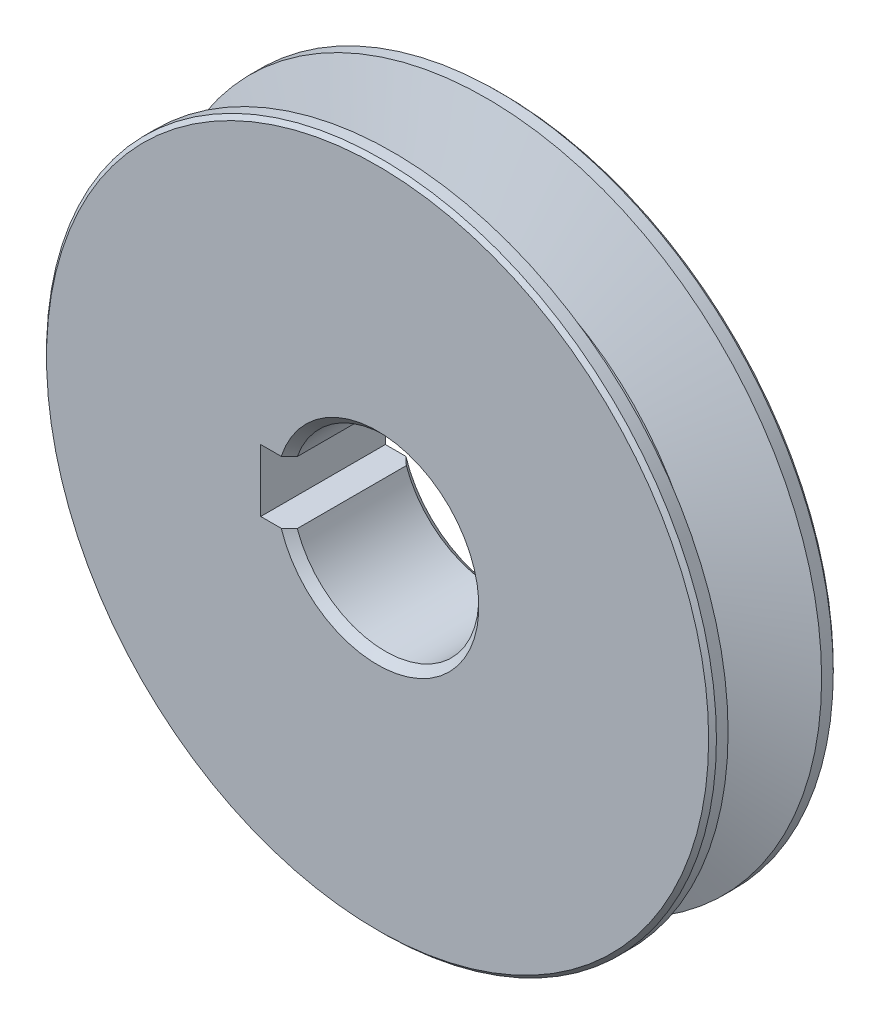
ISO-10303-21;
HEADER;
FILE_DESCRIPTION(('STEP AP214'),'2;1');
FILE_NAME('part.step','',(''),(''),'','','');
FILE_SCHEMA(('AUTOMOTIVE_DESIGN { 1 0 10303 214 1 1 1 1 }'));
ENDSEC;
DATA;
#1=APPLICATION_CONTEXT('core data for automotive mechanical design processes');
#2=APPLICATION_PROTOCOL_DEFINITION('international standard','automotive_design',2000,#1);
#3=PRODUCT_CONTEXT('',#1,'mechanical');
#4=PRODUCT('Part','Part','',(#3));
#5=PRODUCT_RELATED_PRODUCT_CATEGORY('part','',(#4));
#6=PRODUCT_DEFINITION_FORMATION('','',#4);
#7=PRODUCT_DEFINITION_CONTEXT('part definition',#1,'design');
#8=PRODUCT_DEFINITION('design','',#6,#7);
#9=PRODUCT_DEFINITION_SHAPE('','',#8);
#10=(LENGTH_UNIT() NAMED_UNIT(*) SI_UNIT(.MILLI.,.METRE.));
#11=(NAMED_UNIT(*) PLANE_ANGLE_UNIT() SI_UNIT($,.RADIAN.));
#12=(NAMED_UNIT(*) SI_UNIT($,.STERADIAN.) SOLID_ANGLE_UNIT());
#13=UNCERTAINTY_MEASURE_WITH_UNIT(LENGTH_MEASURE(1.E-05),#10,'distance_accuracy_value','');
#14=(GEOMETRIC_REPRESENTATION_CONTEXT(3) GLOBAL_UNCERTAINTY_ASSIGNED_CONTEXT((#13)) GLOBAL_UNIT_ASSIGNED_CONTEXT((#10,
#11,#12)) REPRESENTATION_CONTEXT('',''));
#15=CARTESIAN_POINT('',(0.,0.,0.));
#16=DIRECTION('',(0.,0.,1.));
#17=DIRECTION('',(1.,0.,0.));
#18=AXIS2_PLACEMENT_3D('',#15,#16,#17);
#19=CARTESIAN_POINT('',(0.0594454316027605,2.52282669934369E-12,-2.39999999999939));
#20=DIRECTION('',(0.,0.,1.));
#21=DIRECTION('',(1.,0.,0.));
#22=AXIS2_PLACEMENT_3D('',#19,#20,#21);
#23=CYLINDRICAL_SURFACE('',#22,12.9);
#24=CARTESIAN_POINT('',(0.0594454316027605,2.52282669934369E-12,-2.24999999999935));
#25=DIRECTION('',(0.,0.,-1.));
#26=DIRECTION('',(-1.,0.,0.));
#27=AXIS2_PLACEMENT_3D('',#24,#25,#26);
#28=CIRCLE('',#27,12.9);
#29=CARTESIAN_POINT('',(-12.8405545683972,2.52282669934369E-12,-2.24999999999935));
#30=VERTEX_POINT('',#29);
#31=EDGE_CURVE('E42',#30,#30,#28,.F.);
#32=ORIENTED_EDGE('',*,*,#31,.T.);
#33=EDGE_LOOP('',(#32));
#34=FACE_BOUND('',#33,.T.);
#35=CARTESIAN_POINT('',(0.0594454316027606,2.52282669934369E-12,-1.80110177307778));
#36=DIRECTION('',(0.,0.,1.));
#37=DIRECTION('',(1.,0.,0.));
#38=AXIS2_PLACEMENT_3D('',#35,#36,#37);
#39=CIRCLE('',#38,12.9);
#40=CARTESIAN_POINT('',(12.9594454316028,2.52282669934369E-12,-1.80110177307779));
#41=VERTEX_POINT('',#40);
#42=EDGE_CURVE('E120',#41,#41,#39,.T.);
#43=ORIENTED_EDGE('',*,*,#42,.F.);
#44=EDGE_LOOP('',(#43));
#45=FACE_BOUND('',#44,.T.);
#46=ADVANCED_FACE('F34',(#34,#45),#23,.T.);
#47=CARTESIAN_POINT('',(12.9594454316028,2.52282669934369E-12,-2.39999999999939));
#48=DIRECTION('',(0.,0.,-1.));
#49=DIRECTION('',(-1.,0.,0.));
#50=AXIS2_PLACEMENT_3D('',#47,#48,#49);
#51=PLANE('',#50);
#52=CARTESIAN_POINT('',(0.0594454316027605,2.52282669934369E-12,-2.39999999999939));
#53=DIRECTION('',(0.,0.,-1.));
#54=DIRECTION('',(-1.,0.,0.));
#55=AXIS2_PLACEMENT_3D('',#52,#53,#54);
#56=CIRCLE('',#55,12.75);
#57=CARTESIAN_POINT('',(-12.6905545683972,2.52282669934369E-12,-2.39999999999938));
#58=VERTEX_POINT('',#57);
#59=EDGE_CURVE('E11',#58,#58,#56,.T.);
#60=ORIENTED_EDGE('',*,*,#59,.T.);
#61=EDGE_LOOP('',(#60));
#62=FACE_BOUND('',#61,.T.);
#63=DIRECTION('',(1.,0.,0.));
#64=VECTOR('',#63,1.);
#65=CARTESIAN_POINT('',(-4.44055456839739,-1.19999999999748,-2.39999999999939));
#66=LINE('',#65,#64);
#67=CARTESIAN_POINT('',(-4.44055456839739,-1.19999999999748,-2.39999999999939));
#68=VERTEX_POINT('',#67);
#69=CARTESIAN_POINT('',(-3.65134963801083,-1.19999999999748,-2.39999999999939));
#70=VERTEX_POINT('',#69);
#71=EDGE_CURVE('E101',#68,#70,#66,.T.);
#72=ORIENTED_EDGE('',*,*,#71,.T.);
#73=CARTESIAN_POINT('',(0.0594454316026113,2.52282669934369E-12,-2.39999999999939));
#74=DIRECTION('',(0.,0.,-1.));
#75=DIRECTION('',(-1.,0.,0.));
#76=AXIS2_PLACEMENT_3D('',#73,#74,#75);
#77=CIRCLE('',#76,3.90000000623942);
#78=CARTESIAN_POINT('',(-3.65134963810726,1.19999999970432,-2.39999999999939));
#79=VERTEX_POINT('',#78);
#80=EDGE_CURVE('E184',#70,#79,#77,.F.);
#81=ORIENTED_EDGE('',*,*,#80,.T.);
#82=DIRECTION('',(-1.,0.,0.));
#83=VECTOR('',#82,1.);
#84=CARTESIAN_POINT('',(-3.33466711819825,1.19999999970432,-2.39999999999939));
#85=LINE('',#84,#83);
#86=CARTESIAN_POINT('',(-4.44055456839739,1.19999999970432,-2.39999999999939));
#87=VERTEX_POINT('',#86);
#88=EDGE_CURVE('E99',#79,#87,#85,.T.);
#89=ORIENTED_EDGE('',*,*,#88,.T.);
#90=DIRECTION('',(0.,-1.,0.));
#91=VECTOR('',#90,1.);
#92=CARTESIAN_POINT('',(-4.44055456839739,1.19999999970432,-2.39999999999939));
#93=LINE('',#92,#91);
#94=EDGE_CURVE('E95',#87,#68,#93,.T.);
#95=ORIENTED_EDGE('',*,*,#94,.T.);
#96=EDGE_LOOP('',(#72,#81,#89,#95));
#97=FACE_BOUND('',#96,.T.);
#98=ADVANCED_FACE('F107',(#62,#97),#51,.T.);
#99=CARTESIAN_POINT('',(0.0594454316027611,2.52282669934369E-12,2.40000000000061));
#100=DIRECTION('',(0.,0.,1.));
#101=DIRECTION('',(1.,0.,0.));
#102=AXIS2_PLACEMENT_3D('',#99,#100,#101);
#103=PLANE('',#102);
#104=CARTESIAN_POINT('',(0.0594454316027611,2.52282669934369E-12,2.40000000000061));
#105=DIRECTION('',(0.,0.,1.));
#106=DIRECTION('',(1.,0.,0.));
#107=AXIS2_PLACEMENT_3D('',#104,#105,#106);
#108=CIRCLE('',#107,12.75);
#109=CARTESIAN_POINT('',(12.8094454316027,2.52282669934369E-12,2.40000000000061));
#110=VERTEX_POINT('',#109);
#111=EDGE_CURVE('E331',#110,#110,#108,.T.);
#112=ORIENTED_EDGE('',*,*,#111,.T.);
#113=EDGE_LOOP('',(#112));
#114=FACE_BOUND('',#113,.T.);
#115=DIRECTION('',(-1.,0.,0.));
#116=VECTOR('',#115,1.);
#117=CARTESIAN_POINT('',(-3.33466711819825,1.19999999970432,2.40000000000061));
#118=LINE('',#117,#116);
#119=CARTESIAN_POINT('',(-3.65134963729901,1.19999999970432,2.40000000000061));
#120=VERTEX_POINT('',#119);
#121=CARTESIAN_POINT('',(-4.44055456839739,1.19999999970432,2.40000000000061));
#122=VERTEX_POINT('',#121);
#123=EDGE_CURVE('E110',#120,#122,#118,.T.);
#124=ORIENTED_EDGE('',*,*,#123,.F.);
#125=CARTESIAN_POINT('',(0.0594454316026113,2.52282669934369E-12,2.40000000000061));
#126=DIRECTION('',(0.,0.,1.));
#127=DIRECTION('',(1.,0.,0.));
#128=AXIS2_PLACEMENT_3D('',#125,#126,#127);
#129=CIRCLE('',#128,3.90000000547037);
#130=CARTESIAN_POINT('',(-3.65134963720257,-1.19999999999748,2.40000000000061));
#131=VERTEX_POINT('',#130);
#132=EDGE_CURVE('E57',#120,#131,#129,.F.);
#133=ORIENTED_EDGE('',*,*,#132,.T.);
#134=DIRECTION('',(1.,0.,0.));
#135=VECTOR('',#134,1.);
#136=CARTESIAN_POINT('',(-4.44055456839739,-1.19999999999748,2.40000000000061));
#137=LINE('',#136,#135);
#138=CARTESIAN_POINT('',(-4.44055456839739,-1.19999999999748,2.40000000000062));
#139=VERTEX_POINT('',#138);
#140=EDGE_CURVE('E112',#139,#131,#137,.T.);
#141=ORIENTED_EDGE('',*,*,#140,.F.);
#142=DIRECTION('',(0.,-1.,0.));
#143=VECTOR('',#142,1.);
#144=CARTESIAN_POINT('',(-4.44055456839739,1.19999999970432,2.40000000000061));
#145=LINE('',#144,#143);
#146=EDGE_CURVE('E97',#122,#139,#145,.T.);
#147=ORIENTED_EDGE('',*,*,#146,.F.);
#148=EDGE_LOOP('',(#124,#133,#141,#147));
#149=FACE_BOUND('',#148,.T.);
#150=ADVANCED_FACE('F197',(#114,#149),#103,.T.);
#151=CARTESIAN_POINT('',(0.0594454316027605,2.52282669934369E-12,-2.39999999999939));
#152=DIRECTION('',(0.,0.,1.));
#153=DIRECTION('',(1.,0.,0.));
#154=AXIS2_PLACEMENT_3D('',#151,#152,#153);
#155=CYLINDRICAL_SURFACE('',#154,12.9);
#156=CARTESIAN_POINT('',(0.0594454316027611,2.52282669934369E-12,2.25000000000063));
#157=DIRECTION('',(0.,0.,1.));
#158=DIRECTION('',(1.,0.,0.));
#159=AXIS2_PLACEMENT_3D('',#156,#157,#158);
#160=CIRCLE('',#159,12.9);
#161=CARTESIAN_POINT('',(12.9594454316028,2.52282669934369E-12,2.25000000000063));
#162=VERTEX_POINT('',#161);
#163=EDGE_CURVE('E329',#162,#162,#160,.F.);
#164=ORIENTED_EDGE('',*,*,#163,.T.);
#165=EDGE_LOOP('',(#164));
#166=FACE_BOUND('',#165,.T.);
#167=CARTESIAN_POINT('',(0.059445431602761,2.52282669934369E-12,1.80110177307902));
#168=DIRECTION('',(0.,0.,1.));
#169=DIRECTION('',(1.,0.,0.));
#170=AXIS2_PLACEMENT_3D('',#167,#168,#169);
#171=CIRCLE('',#170,12.9);
#172=CARTESIAN_POINT('',(12.9594454316028,2.52282669934369E-12,1.80110177307901));
#173=VERTEX_POINT('',#172);
#174=EDGE_CURVE('E134',#173,#173,#171,.T.);
#175=ORIENTED_EDGE('',*,*,#174,.T.);
#176=EDGE_LOOP('',(#175));
#177=FACE_BOUND('',#176,.T.);
#178=ADVANCED_FACE('F201',(#166,#177),#155,.T.);
#179=CARTESIAN_POINT('',(0.059445431602761,2.52282669934369E-12,1.80110177307902));
#180=DIRECTION('',(0.,0.,1.));
#181=DIRECTION('',(1.,0.,0.));
#182=AXIS2_PLACEMENT_3D('',#179,#180,#181);
#183=CONICAL_SURFACE('',#182,12.9,1.22173047639594);
#184=CARTESIAN_POINT('',(0.0594454316027609,2.52282669934369E-12,0.600000000000205));
#185=DIRECTION('',(0.,0.,1.));
#186=DIRECTION('',(1.,0.,0.));
#187=AXIS2_PLACEMENT_3D('',#184,#185,#186);
#188=CIRCLE('',#187,9.6);
#189=CARTESIAN_POINT('',(9.65944543160276,2.52282669934369E-12,0.600000000000203));
#190=VERTEX_POINT('',#189);
#191=EDGE_CURVE('E131',#190,#190,#188,.T.);
#192=ORIENTED_EDGE('',*,*,#191,.T.);
#193=EDGE_LOOP('',(#192));
#194=FACE_BOUND('',#193,.T.);
#195=ORIENTED_EDGE('',*,*,#174,.F.);
#196=EDGE_LOOP('',(#195));
#197=FACE_BOUND('',#196,.T.);
#198=ADVANCED_FACE('F205',(#194,#197),#183,.T.);
#199=CARTESIAN_POINT('',(0.0594454316027605,2.52282669934369E-12,-2.39999999999939));
#200=DIRECTION('',(0.,0.,1.));
#201=DIRECTION('',(1.,0.,0.));
#202=AXIS2_PLACEMENT_3D('',#199,#200,#201);
#203=CYLINDRICAL_SURFACE('',#202,9.6);
#204=CARTESIAN_POINT('',(0.0594454316027607,2.52282669934369E-12,-0.599999999999384));
#205=DIRECTION('',(0.,0.,1.));
#206=DIRECTION('',(1.,0.,0.));
#207=AXIS2_PLACEMENT_3D('',#204,#205,#206);
#208=CIRCLE('',#207,9.6);
#209=CARTESIAN_POINT('',(9.65944543160276,2.52282669934369E-12,-0.599999999999386));
#210=VERTEX_POINT('',#209);
#211=EDGE_CURVE('E128',#210,#210,#208,.T.);
#212=ORIENTED_EDGE('',*,*,#211,.T.);
#213=EDGE_LOOP('',(#212));
#214=FACE_BOUND('',#213,.T.);
#215=ORIENTED_EDGE('',*,*,#191,.F.);
#216=EDGE_LOOP('',(#215));
#217=FACE_BOUND('',#216,.T.);
#218=ADVANCED_FACE('F209',(#214,#217),#203,.T.);
#219=CARTESIAN_POINT('',(0.0594454316027607,2.52282669934369E-12,-0.599999999999384));
#220=DIRECTION('',(0.,0.,-1.));
#221=DIRECTION('',(-1.,0.,0.));
#222=AXIS2_PLACEMENT_3D('',#219,#220,#221);
#223=CONICAL_SURFACE('',#222,9.6,1.22173047639605);
#224=ORIENTED_EDGE('',*,*,#42,.T.);
#225=EDGE_LOOP('',(#224));
#226=FACE_BOUND('',#225,.T.);
#227=ORIENTED_EDGE('',*,*,#211,.F.);
#228=EDGE_LOOP('',(#227));
#229=FACE_BOUND('',#228,.T.);
#230=ADVANCED_FACE('F212',(#226,#229),#223,.T.);
#231=CARTESIAN_POINT('',(-4.44055456839739,1.19999999970432,-2.39999999999939));
#232=DIRECTION('',(-1.,0.,0.));
#233=DIRECTION('',(0.,0.,1.));
#234=AXIS2_PLACEMENT_3D('',#231,#232,#233);
#235=PLANE('',#234);
#236=ORIENTED_EDGE('',*,*,#146,.T.);
#237=DIRECTION('',(0.,0.,1.));
#238=VECTOR('',#237,1.);
#239=CARTESIAN_POINT('',(-4.44055456839739,-1.19999999999748,-2.39999999999939));
#240=LINE('',#239,#238);
#241=EDGE_CURVE('E91',#68,#139,#240,.T.);
#242=ORIENTED_EDGE('',*,*,#241,.F.);
#243=ORIENTED_EDGE('',*,*,#94,.F.);
#244=DIRECTION('',(0.,0.,1.));
#245=VECTOR('',#244,1.);
#246=CARTESIAN_POINT('',(-4.44055456839739,1.19999999970432,-2.39999999999939));
#247=LINE('',#246,#245);
#248=EDGE_CURVE('E118',#87,#122,#247,.T.);
#249=ORIENTED_EDGE('',*,*,#248,.T.);
#250=EDGE_LOOP('',(#236,#242,#243,#249));
#251=FACE_BOUND('',#250,.T.);
#252=ADVANCED_FACE('F92',(#251),#235,.F.);
#253=CARTESIAN_POINT('',(-3.33466711819825,1.19999999970432,-2.39999999999939));
#254=DIRECTION('',(0.,1.,0.));
#255=DIRECTION('',(0.,0.,1.));
#256=AXIS2_PLACEMENT_3D('',#253,#254,#255);
#257=PLANE('',#256);
#258=DIRECTION('',(0.,0.,1.));
#259=VECTOR('',#258,1.);
#260=CARTESIAN_POINT('',(-3.33466711819825,1.19999999970432,-2.39999999999939));
#261=LINE('',#260,#259);
#262=CARTESIAN_POINT('',(-3.33466711819825,1.19999999970432,-2.09999999452902));
#263=VERTEX_POINT('',#262);
#264=CARTESIAN_POINT('',(-3.33466711819825,1.19999999970432,2.0999999937612));
#265=VERTEX_POINT('',#264);
#266=EDGE_CURVE('E121',#263,#265,#261,.T.);
#267=ORIENTED_EDGE('',*,*,#266,.T.);
#268=CARTESIAN_POINT('',(-3.33466711819825,1.19999999970432,2.0999999937612));
#269=CARTESIAN_POINT('',(-3.38756168295526,1.19999999970432,2.14987950799116));
#270=CARTESIAN_POINT('',(-3.44039917663128,1.19999999970432,2.19981926693219));
#271=CARTESIAN_POINT('',(-3.54596001631963,1.19999999970432,2.29981926902455));
#272=CARTESIAN_POINT('',(-3.59868336234387,1.19999999970432,2.34987951216333));
#273=CARTESIAN_POINT('',(-3.65134963729901,1.19999999970432,2.40000000000062));
#274=B_SPLINE_CURVE_WITH_KNOTS('',3,(#268,#269,#270,#271,#272,#273),.UNSPECIFIED.,.F.,.F.,(4,2,
4),(0.,0.218110115192896,0.436220207650685),.UNSPECIFIED.);
#275=EDGE_CURVE('E150',#265,#120,#274,.T.);
#276=ORIENTED_EDGE('',*,*,#275,.T.);
#277=ORIENTED_EDGE('',*,*,#123,.T.);
#278=ORIENTED_EDGE('',*,*,#248,.F.);
#279=ORIENTED_EDGE('',*,*,#88,.F.);
#280=CARTESIAN_POINT('',(-3.65134963810726,1.19999999970432,-2.39999999999939));
#281=CARTESIAN_POINT('',(-3.59868336301735,1.19999999970432,-2.34987951228973));
#282=CARTESIAN_POINT('',(-3.54596001685837,1.19999999970432,-2.29981926927886));
#283=CARTESIAN_POINT('',(-3.44039917690059,1.19999999970432,-2.19981926744284));
#284=CARTESIAN_POINT('',(-3.3875616830899,1.19999999970432,-2.14987950863026));
#285=CARTESIAN_POINT('',(-3.33466711819825,1.19999999970432,-2.09999999452902));
#286=B_SPLINE_CURVE_WITH_KNOTS('',3,(#280,#281,#282,#283,#284,#285),.UNSPECIFIED.,.F.,.F.,(4,2,
4),(0.,0.218110092486728,0.436220207708565),.UNSPECIFIED.);
#287=EDGE_CURVE('E142',#79,#263,#286,.T.);
#288=ORIENTED_EDGE('',*,*,#287,.T.);
#289=EDGE_LOOP('',(#267,#276,#277,#278,#279,#288));
#290=FACE_BOUND('',#289,.T.);
#291=ADVANCED_FACE('F159',(#290),#257,.F.);
#292=CARTESIAN_POINT('',(-4.44055456839739,-1.19999999999748,-2.39999999999939));
#293=DIRECTION('',(0.,-1.,0.));
#294=DIRECTION('',(0.,0.,-1.));
#295=AXIS2_PLACEMENT_3D('',#292,#293,#294);
#296=PLANE('',#295);
#297=ORIENTED_EDGE('',*,*,#140,.T.);
#298=CARTESIAN_POINT('',(-3.65134963720257,-1.19999999999748,2.40000000000062));
#299=CARTESIAN_POINT('',(-3.598683362246,-1.19999999999748,2.34987951216326));
#300=CARTESIAN_POINT('',(-3.54596001622029,-1.19999999999748,2.29981926902445));
#301=CARTESIAN_POINT('',(-3.44039917652894,-1.19999999999748,2.19981926693208));
#302=CARTESIAN_POINT('',(-3.3875616828514,-1.19999999999748,2.14987950799109));
#303=CARTESIAN_POINT('',(-3.33466711809282,-1.19999999999748,2.0999999937612));
#304=B_SPLINE_CURVE_WITH_KNOTS('',3,(#298,#299,#300,#301,#302,#303),.UNSPECIFIED.,.F.,.F.,(4,2,
4),(0.,0.218110092461055,0.436220207657217),.UNSPECIFIED.);
#305=CARTESIAN_POINT('',(-3.33466711809282,-1.19999999999748,2.0999999937612));
#306=VERTEX_POINT('',#305);
#307=EDGE_CURVE('E178',#131,#306,#304,.T.);
#308=ORIENTED_EDGE('',*,*,#307,.T.);
#309=DIRECTION('',(0.,0.,1.));
#310=VECTOR('',#309,1.);
#311=CARTESIAN_POINT('',(-3.33466711809282,-1.19999999999748,-2.39999999999939));
#312=LINE('',#311,#310);
#313=CARTESIAN_POINT('',(-3.33466711809282,-1.19999999999748,-2.09999999452902));
#314=VERTEX_POINT('',#313);
#315=EDGE_CURVE('E98',#314,#306,#312,.T.);
#316=ORIENTED_EDGE('',*,*,#315,.F.);
#317=CARTESIAN_POINT('',(-3.33466711809282,-1.19999999999748,-2.09999999452902));
#318=CARTESIAN_POINT('',(-3.38756168298604,-1.19999999999748,-2.14987950863018));
#319=CARTESIAN_POINT('',(-3.44039917679826,-1.19999999999748,-2.19981926744273));
#320=CARTESIAN_POINT('',(-3.54596001675903,-1.19999999999748,-2.29981926927875));
#321=CARTESIAN_POINT('',(-3.59868336291948,-1.19999999999748,-2.34987951228966));
#322=CARTESIAN_POINT('',(-3.65134963801083,-1.19999999999748,-2.39999999999939));
#323=B_SPLINE_CURVE_WITH_KNOTS('',3,(#317,#318,#319,#320,#321,#322),.UNSPECIFIED.,.F.,.F.,(4,2,
4),(0.,0.218110115225102,0.436220207715097),.UNSPECIFIED.);
#324=EDGE_CURVE('E49',#314,#70,#323,.T.);
#325=ORIENTED_EDGE('',*,*,#324,.T.);
#326=ORIENTED_EDGE('',*,*,#71,.F.);
#327=ORIENTED_EDGE('',*,*,#241,.T.);
#328=EDGE_LOOP('',(#297,#308,#316,#325,#326,#327));
#329=FACE_BOUND('',#328,.T.);
#330=ADVANCED_FACE('F102',(#329),#296,.F.);
#331=CARTESIAN_POINT('',(0.0594454316026113,2.52282669934369E-12,-2.39999999999939));
#332=DIRECTION('',(0.,0.,1.));
#333=DIRECTION('',(1.,0.,0.));
#334=AXIS2_PLACEMENT_3D('',#331,#332,#333);
#335=CYLINDRICAL_SURFACE('',#334,3.6);
#336=ORIENTED_EDGE('',*,*,#315,.T.);
#337=CARTESIAN_POINT('',(0.0594454316026113,2.52282669934369E-12,2.0999999937612));
#338=DIRECTION('',(0.,0.,1.));
#339=DIRECTION('',(1.,0.,0.));
#340=AXIS2_PLACEMENT_3D('',#337,#338,#339);
#341=CIRCLE('',#340,3.6);
#342=EDGE_CURVE('E139',#306,#265,#341,.T.);
#343=ORIENTED_EDGE('',*,*,#342,.T.);
#344=ORIENTED_EDGE('',*,*,#266,.F.);
#345=CARTESIAN_POINT('',(0.0594454316026113,2.52282669934369E-12,-2.09999999452902));
#346=DIRECTION('',(0.,0.,-1.));
#347=DIRECTION('',(-1.,0.,0.));
#348=AXIS2_PLACEMENT_3D('',#345,#346,#347);
#349=CIRCLE('',#348,3.6);
#350=EDGE_CURVE('E137',#263,#314,#349,.T.);
#351=ORIENTED_EDGE('',*,*,#350,.T.);
#352=EDGE_LOOP('',(#336,#343,#344,#351));
#353=FACE_BOUND('',#352,.T.);
#354=ADVANCED_FACE('F165',(#353),#335,.F.);
#355=CARTESIAN_POINT('',(0.0594454316026113,2.52282669934369E-12,2.0999999937612));
#356=DIRECTION('',(0.,0.,1.));
#357=DIRECTION('',(1.,0.,0.));
#358=AXIS2_PLACEMENT_3D('',#355,#356,#357);
#359=CONICAL_SURFACE('',#358,3.6,0.785398162115705);
#360=ORIENTED_EDGE('',*,*,#307,.F.);
#361=ORIENTED_EDGE('',*,*,#132,.F.);
#362=ORIENTED_EDGE('',*,*,#275,.F.);
#363=ORIENTED_EDGE('',*,*,#342,.F.);
#364=EDGE_LOOP('',(#360,#361,#362,#363));
#365=FACE_BOUND('',#364,.T.);
#366=ADVANCED_FACE('F186',(#365),#359,.F.);
#367=CARTESIAN_POINT('',(0.0594454316026113,2.52282669934369E-12,-2.39999999999939));
#368=DIRECTION('',(0.,0.,-1.));
#369=DIRECTION('',(-1.,0.,0.));
#370=AXIS2_PLACEMENT_3D('',#367,#368,#369);
#371=CONICAL_SURFACE('',#370,3.90000000623942,0.785398164679191);
#372=ORIENTED_EDGE('',*,*,#324,.F.);
#373=ORIENTED_EDGE('',*,*,#350,.F.);
#374=ORIENTED_EDGE('',*,*,#287,.F.);
#375=ORIENTED_EDGE('',*,*,#80,.F.);
#376=EDGE_LOOP('',(#372,#373,#374,#375));
#377=FACE_BOUND('',#376,.T.);
#378=ADVANCED_FACE('F157',(#377),#371,.F.);
#379=CARTESIAN_POINT('',(0.0594454316027611,2.52282669934369E-12,2.40000000000061));
#380=DIRECTION('',(0.,0.,-1.));
#381=DIRECTION('',(-1.,0.,0.));
#382=AXIS2_PLACEMENT_3D('',#379,#380,#381);
#383=CONICAL_SURFACE('',#382,12.75,0.785398163397601);
#384=ORIENTED_EDGE('',*,*,#163,.F.);
#385=EDGE_LOOP('',(#384));
#386=FACE_BOUND('',#385,.T.);
#387=ORIENTED_EDGE('',*,*,#111,.F.);
#388=EDGE_LOOP('',(#387));
#389=FACE_BOUND('',#388,.T.);
#390=ADVANCED_FACE('F254',(#386,#389),#383,.T.);
#391=CARTESIAN_POINT('',(0.0594454316027605,2.52282669934369E-12,-2.24999999999935));
#392=DIRECTION('',(0.,0.,1.));
#393=DIRECTION('',(1.,0.,0.));
#394=AXIS2_PLACEMENT_3D('',#391,#392,#393);
#395=CONICAL_SURFACE('',#394,12.9,0.785398163397303);
#396=ORIENTED_EDGE('',*,*,#59,.F.);
#397=EDGE_LOOP('',(#396));
#398=FACE_BOUND('',#397,.T.);
#399=ORIENTED_EDGE('',*,*,#31,.F.);
#400=EDGE_LOOP('',(#399));
#401=FACE_BOUND('',#400,.T.);
#402=ADVANCED_FACE('F36',(#398,#401),#395,.T.);
#403=CLOSED_SHELL('',(#46,#98,#150,#178,#198,#218,#230,#252,#291,#330,#354,#366,#378,#390,#402));
#404=MANIFOLD_SOLID_BREP('B2',#403);
#405=ADVANCED_BREP_SHAPE_REPRESENTATION('',(#18,#404),#14);
#406=SHAPE_DEFINITION_REPRESENTATION(#9,#405);
ENDSEC;
END-ISO-10303-21;
